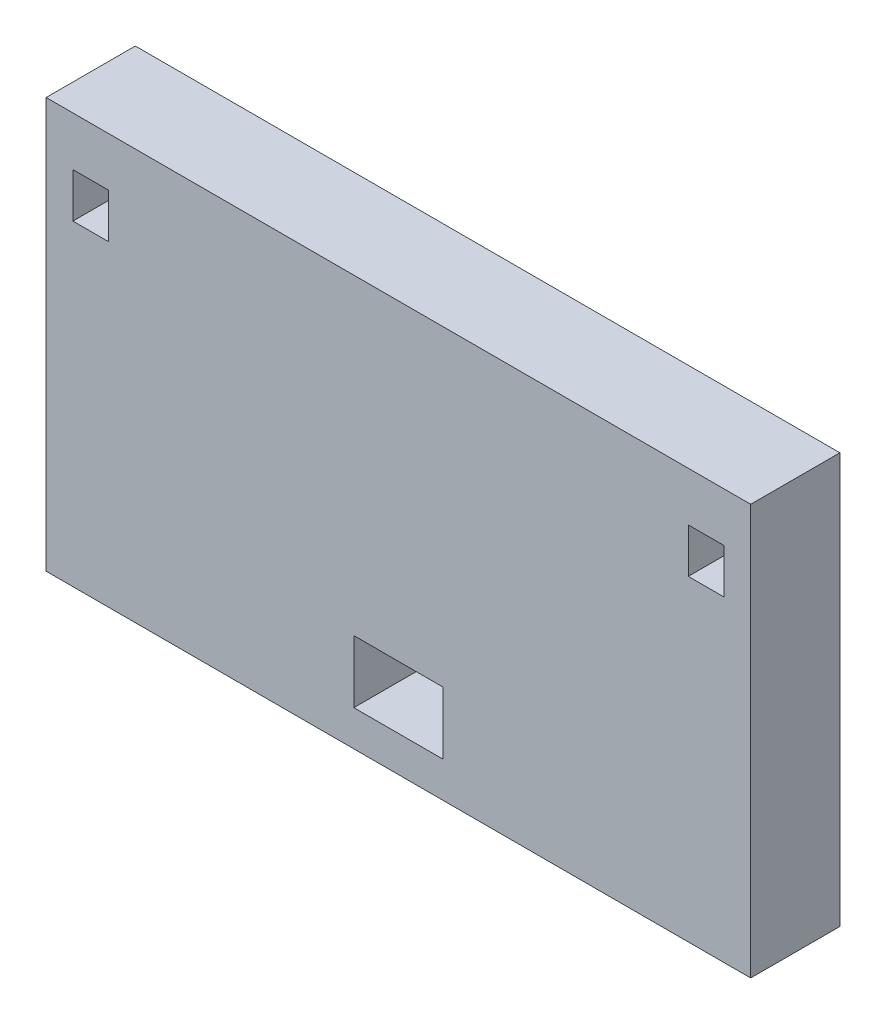
ISO-10303-21;
HEADER;
FILE_DESCRIPTION(('STEP AP214'),'2;1');
FILE_NAME('part.step','',(''),(''),'','','');
FILE_SCHEMA(('AUTOMOTIVE_DESIGN { 1 0 10303 214 1 1 1 1 }'));
ENDSEC;
DATA;
#1=APPLICATION_CONTEXT('core data for automotive mechanical design processes');
#2=APPLICATION_PROTOCOL_DEFINITION('international standard','automotive_design',2000,#1);
#3=PRODUCT_CONTEXT('',#1,'mechanical');
#4=PRODUCT('Part','Part','',(#3));
#5=PRODUCT_RELATED_PRODUCT_CATEGORY('part','',(#4));
#6=PRODUCT_DEFINITION_FORMATION('','',#4);
#7=PRODUCT_DEFINITION_CONTEXT('part definition',#1,'design');
#8=PRODUCT_DEFINITION('design','',#6,#7);
#9=PRODUCT_DEFINITION_SHAPE('','',#8);
#10=(LENGTH_UNIT() NAMED_UNIT(*) SI_UNIT(.MILLI.,.METRE.));
#11=(NAMED_UNIT(*) PLANE_ANGLE_UNIT() SI_UNIT($,.RADIAN.));
#12=(NAMED_UNIT(*) SI_UNIT($,.STERADIAN.) SOLID_ANGLE_UNIT());
#13=UNCERTAINTY_MEASURE_WITH_UNIT(LENGTH_MEASURE(1.E-05),#10,'distance_accuracy_value','');
#14=(GEOMETRIC_REPRESENTATION_CONTEXT(3) GLOBAL_UNCERTAINTY_ASSIGNED_CONTEXT((#13)) GLOBAL_UNIT_ASSIGNED_CONTEXT((#10,
#11,#12)) REPRESENTATION_CONTEXT('',''));
#15=CARTESIAN_POINT('',(0.,0.,0.));
#16=DIRECTION('',(0.,0.,1.));
#17=DIRECTION('',(1.,0.,0.));
#18=AXIS2_PLACEMENT_3D('',#15,#16,#17);
#19=CARTESIAN_POINT('',(0.,0.,10.));
#20=DIRECTION('',(0.,0.,-1.));
#21=DIRECTION('',(-1.,0.,0.));
#22=AXIS2_PLACEMENT_3D('',#19,#20,#21);
#23=PLANE('',#22);
#24=DIRECTION('',(0.,1.,0.));
#25=VECTOR('',#24,1.);
#26=CARTESIAN_POINT('',(36.5,33.1115422644165,10.));
#27=LINE('',#26,#25);
#28=CARTESIAN_POINT('',(36.5,33.1115422644165,10.));
#29=VERTEX_POINT('',#28);
#30=CARTESIAN_POINT('',(36.5,38.1115422644165,10.));
#31=VERTEX_POINT('',#30);
#32=EDGE_CURVE('E201',#29,#31,#27,.T.);
#33=ORIENTED_EDGE('',*,*,#32,.F.);
#34=DIRECTION('',(1.,0.,0.));
#35=VECTOR('',#34,1.);
#36=CARTESIAN_POINT('',(32.5,33.1115422644165,10.));
#37=LINE('',#36,#35);
#38=CARTESIAN_POINT('',(32.5,33.1115422644165,10.));
#39=VERTEX_POINT('',#38);
#40=EDGE_CURVE('E212',#39,#29,#37,.T.);
#41=ORIENTED_EDGE('',*,*,#40,.F.);
#42=DIRECTION('',(0.,-1.,0.));
#43=VECTOR('',#42,1.);
#44=CARTESIAN_POINT('',(32.5,33.1115422644165,10.));
#45=LINE('',#44,#43);
#46=CARTESIAN_POINT('',(32.5,38.1115422644165,10.));
#47=VERTEX_POINT('',#46);
#48=EDGE_CURVE('E208',#47,#39,#45,.T.);
#49=ORIENTED_EDGE('',*,*,#48,.F.);
#50=DIRECTION('',(-1.,0.,0.));
#51=VECTOR('',#50,1.);
#52=CARTESIAN_POINT('',(32.5,38.1115422644165,10.));
#53=LINE('',#52,#51);
#54=EDGE_CURVE('E204',#31,#47,#53,.T.);
#55=ORIENTED_EDGE('',*,*,#54,.F.);
#56=EDGE_LOOP('',(#33,#41,#49,#55));
#57=FACE_BOUND('',#56,.T.);
#58=DIRECTION('',(0.,-1.,0.));
#59=VECTOR('',#58,1.);
#60=CARTESIAN_POINT('',(-39.5,-2.38845773558347,10.));
#61=LINE('',#60,#59);
#62=CARTESIAN_POINT('',(-39.5,43.6115422644165,10.));
#63=VERTEX_POINT('',#62);
#64=CARTESIAN_POINT('',(-39.5,-2.38845773558347,10.));
#65=VERTEX_POINT('',#64);
#66=EDGE_CURVE('E287',#63,#65,#61,.T.);
#67=ORIENTED_EDGE('',*,*,#66,.T.);
#68=DIRECTION('',(1.,0.,0.));
#69=VECTOR('',#68,1.);
#70=CARTESIAN_POINT('',(-39.5,-2.38845773558347,10.));
#71=LINE('',#70,#69);
#72=CARTESIAN_POINT('',(39.5,-2.38845773558347,10.));
#73=VERTEX_POINT('',#72);
#74=EDGE_CURVE('E291',#65,#73,#71,.T.);
#75=ORIENTED_EDGE('',*,*,#74,.T.);
#76=DIRECTION('',(0.,1.,0.));
#77=VECTOR('',#76,1.);
#78=CARTESIAN_POINT('',(39.5,-2.38845773558347,10.));
#79=LINE('',#78,#77);
#80=CARTESIAN_POINT('',(39.5,43.6115422644165,10.));
#81=VERTEX_POINT('',#80);
#82=EDGE_CURVE('E295',#73,#81,#79,.T.);
#83=ORIENTED_EDGE('',*,*,#82,.T.);
#84=DIRECTION('',(-1.,0.,0.));
#85=VECTOR('',#84,1.);
#86=CARTESIAN_POINT('',(-39.5,43.6115422644165,10.));
#87=LINE('',#86,#85);
#88=EDGE_CURVE('E298',#81,#63,#87,.T.);
#89=ORIENTED_EDGE('',*,*,#88,.T.);
#90=EDGE_LOOP('',(#67,#75,#83,#89));
#91=FACE_BOUND('',#90,.T.);
#92=DIRECTION('',(0.,-1.,0.));
#93=VECTOR('',#92,1.);
#94=CARTESIAN_POINT('',(-5.,1.61154226441653,10.));
#95=LINE('',#94,#93);
#96=CARTESIAN_POINT('',(-5.,8.61154226441653,10.));
#97=VERTEX_POINT('',#96);
#98=CARTESIAN_POINT('',(-5.,1.61154226441653,10.));
#99=VERTEX_POINT('',#98);
#100=EDGE_CURVE('E244',#97,#99,#95,.T.);
#101=ORIENTED_EDGE('',*,*,#100,.F.);
#102=DIRECTION('',(-1.,0.,0.));
#103=VECTOR('',#102,1.);
#104=CARTESIAN_POINT('',(5.,8.61154226441653,10.));
#105=LINE('',#104,#103);
#106=CARTESIAN_POINT('',(5.,8.61154226441654,10.));
#107=VERTEX_POINT('',#106);
#108=EDGE_CURVE('E255',#107,#97,#105,.T.);
#109=ORIENTED_EDGE('',*,*,#108,.F.);
#110=DIRECTION('',(0.,1.,0.));
#111=VECTOR('',#110,1.);
#112=CARTESIAN_POINT('',(5.,1.61154226441654,10.));
#113=LINE('',#112,#111);
#114=CARTESIAN_POINT('',(5.,1.61154226441654,10.));
#115=VERTEX_POINT('',#114);
#116=EDGE_CURVE('E251',#115,#107,#113,.T.);
#117=ORIENTED_EDGE('',*,*,#116,.F.);
#118=DIRECTION('',(1.,0.,0.));
#119=VECTOR('',#118,1.);
#120=CARTESIAN_POINT('',(5.,1.61154226441654,10.));
#121=LINE('',#120,#119);
#122=EDGE_CURVE('E247',#99,#115,#121,.T.);
#123=ORIENTED_EDGE('',*,*,#122,.F.);
#124=EDGE_LOOP('',(#101,#109,#117,#123));
#125=FACE_BOUND('',#124,.T.);
#126=DIRECTION('',(0.,1.,0.));
#127=VECTOR('',#126,1.);
#128=CARTESIAN_POINT('',(-32.5,33.1115422644165,10.));
#129=LINE('',#128,#127);
#130=CARTESIAN_POINT('',(-32.5,33.1115422644165,10.));
#131=VERTEX_POINT('',#130);
#132=CARTESIAN_POINT('',(-32.5,38.1115422644165,10.));
#133=VERTEX_POINT('',#132);
#134=EDGE_CURVE('E153',#131,#133,#129,.T.);
#135=ORIENTED_EDGE('',*,*,#134,.F.);
#136=DIRECTION('',(1.,0.,0.));
#137=VECTOR('',#136,1.);
#138=CARTESIAN_POINT('',(-32.5,33.1115422644165,10.));
#139=LINE('',#138,#137);
#140=CARTESIAN_POINT('',(-36.5,33.1115422644165,10.));
#141=VERTEX_POINT('',#140);
#142=EDGE_CURVE('E179',#141,#131,#139,.T.);
#143=ORIENTED_EDGE('',*,*,#142,.F.);
#144=DIRECTION('',(0.,-1.,0.));
#145=VECTOR('',#144,1.);
#146=CARTESIAN_POINT('',(-36.5,33.1115422644165,10.));
#147=LINE('',#146,#145);
#148=CARTESIAN_POINT('',(-36.5,38.1115422644165,10.));
#149=VERTEX_POINT('',#148);
#150=EDGE_CURVE('E175',#149,#141,#147,.T.);
#151=ORIENTED_EDGE('',*,*,#150,.F.);
#152=DIRECTION('',(-1.,0.,0.));
#153=VECTOR('',#152,1.);
#154=CARTESIAN_POINT('',(-32.5,38.1115422644165,10.));
#155=LINE('',#154,#153);
#156=EDGE_CURVE('E162',#133,#149,#155,.T.);
#157=ORIENTED_EDGE('',*,*,#156,.F.);
#158=EDGE_LOOP('',(#135,#143,#151,#157));
#159=FACE_BOUND('',#158,.T.);
#160=ADVANCED_FACE('F39',(#57,#91,#125,#159),#23,.F.);
#161=CARTESIAN_POINT('',(0.,0.,0.));
#162=DIRECTION('',(0.,0.,-1.));
#163=DIRECTION('',(-1.,0.,0.));
#164=AXIS2_PLACEMENT_3D('',#161,#162,#163);
#165=PLANE('',#164);
#166=DIRECTION('',(0.,-1.,0.));
#167=VECTOR('',#166,1.);
#168=CARTESIAN_POINT('',(-39.5,-2.38845773558347,0.));
#169=LINE('',#168,#167);
#170=CARTESIAN_POINT('',(-39.5,43.6115422644165,0.));
#171=VERTEX_POINT('',#170);
#172=CARTESIAN_POINT('',(-39.5,-2.38845773558347,0.));
#173=VERTEX_POINT('',#172);
#174=EDGE_CURVE('E286',#171,#173,#169,.T.);
#175=ORIENTED_EDGE('',*,*,#174,.F.);
#176=DIRECTION('',(-1.,0.,0.));
#177=VECTOR('',#176,1.);
#178=CARTESIAN_POINT('',(-39.5,43.6115422644165,0.));
#179=LINE('',#178,#177);
#180=CARTESIAN_POINT('',(39.5,43.6115422644165,0.));
#181=VERTEX_POINT('',#180);
#182=EDGE_CURVE('E292',#181,#171,#179,.T.);
#183=ORIENTED_EDGE('',*,*,#182,.F.);
#184=DIRECTION('',(0.,1.,0.));
#185=VECTOR('',#184,1.);
#186=CARTESIAN_POINT('',(39.5,-2.38845773558347,0.));
#187=LINE('',#186,#185);
#188=CARTESIAN_POINT('',(39.5,-2.38845773558347,0.));
#189=VERTEX_POINT('',#188);
#190=EDGE_CURVE('E308',#189,#181,#187,.T.);
#191=ORIENTED_EDGE('',*,*,#190,.F.);
#192=DIRECTION('',(1.,0.,0.));
#193=VECTOR('',#192,1.);
#194=CARTESIAN_POINT('',(-39.5,-2.38845773558347,0.));
#195=LINE('',#194,#193);
#196=EDGE_CURVE('E305',#173,#189,#195,.T.);
#197=ORIENTED_EDGE('',*,*,#196,.F.);
#198=EDGE_LOOP('',(#175,#183,#191,#197));
#199=FACE_BOUND('',#198,.T.);
#200=DIRECTION('',(-1.,0.,0.));
#201=VECTOR('',#200,1.);
#202=CARTESIAN_POINT('',(5.,8.61154226441653,0.));
#203=LINE('',#202,#201);
#204=CARTESIAN_POINT('',(5.,8.61154226441653,0.));
#205=VERTEX_POINT('',#204);
#206=CARTESIAN_POINT('',(-5.,8.61154226441653,0.));
#207=VERTEX_POINT('',#206);
#208=EDGE_CURVE('E248',#205,#207,#203,.T.);
#209=ORIENTED_EDGE('',*,*,#208,.T.);
#210=DIRECTION('',(0.,-1.,0.));
#211=VECTOR('',#210,1.);
#212=CARTESIAN_POINT('',(-5.,1.61154226441653,0.));
#213=LINE('',#212,#211);
#214=CARTESIAN_POINT('',(-5.,1.61154226441653,0.));
#215=VERTEX_POINT('',#214);
#216=EDGE_CURVE('E243',#207,#215,#213,.T.);
#217=ORIENTED_EDGE('',*,*,#216,.T.);
#218=DIRECTION('',(1.,0.,0.));
#219=VECTOR('',#218,1.);
#220=CARTESIAN_POINT('',(5.,1.61154226441654,0.));
#221=LINE('',#220,#219);
#222=CARTESIAN_POINT('',(5.,1.61154226441654,0.));
#223=VERTEX_POINT('',#222);
#224=EDGE_CURVE('E262',#215,#223,#221,.T.);
#225=ORIENTED_EDGE('',*,*,#224,.T.);
#226=DIRECTION('',(0.,1.,0.));
#227=VECTOR('',#226,1.);
#228=CARTESIAN_POINT('',(5.,1.61154226441654,0.));
#229=LINE('',#228,#227);
#230=EDGE_CURVE('E266',#223,#205,#229,.T.);
#231=ORIENTED_EDGE('',*,*,#230,.T.);
#232=EDGE_LOOP('',(#209,#217,#225,#231));
#233=FACE_BOUND('',#232,.T.);
#234=DIRECTION('',(1.,0.,0.));
#235=VECTOR('',#234,1.);
#236=CARTESIAN_POINT('',(32.5,33.1115422644165,0.));
#237=LINE('',#236,#235);
#238=CARTESIAN_POINT('',(32.5,33.1115422644165,0.));
#239=VERTEX_POINT('',#238);
#240=CARTESIAN_POINT('',(36.5,33.1115422644165,0.));
#241=VERTEX_POINT('',#240);
#242=EDGE_CURVE('E205',#239,#241,#237,.T.);
#243=ORIENTED_EDGE('',*,*,#242,.T.);
#244=DIRECTION('',(0.,1.,0.));
#245=VECTOR('',#244,1.);
#246=CARTESIAN_POINT('',(36.5,33.1115422644165,0.));
#247=LINE('',#246,#245);
#248=CARTESIAN_POINT('',(36.5,38.1115422644165,0.));
#249=VERTEX_POINT('',#248);
#250=EDGE_CURVE('E171',#241,#249,#247,.T.);
#251=ORIENTED_EDGE('',*,*,#250,.T.);
#252=DIRECTION('',(-1.,0.,0.));
#253=VECTOR('',#252,1.);
#254=CARTESIAN_POINT('',(32.5,38.1115422644165,0.));
#255=LINE('',#254,#253);
#256=CARTESIAN_POINT('',(32.5,38.1115422644165,0.));
#257=VERTEX_POINT('',#256);
#258=EDGE_CURVE('E219',#249,#257,#255,.T.);
#259=ORIENTED_EDGE('',*,*,#258,.T.);
#260=DIRECTION('',(0.,-1.,0.));
#261=VECTOR('',#260,1.);
#262=CARTESIAN_POINT('',(32.5,33.1115422644165,0.));
#263=LINE('',#262,#261);
#264=EDGE_CURVE('E223',#257,#239,#263,.T.);
#265=ORIENTED_EDGE('',*,*,#264,.T.);
#266=EDGE_LOOP('',(#243,#251,#259,#265));
#267=FACE_BOUND('',#266,.T.);
#268=DIRECTION('',(1.,0.,0.));
#269=VECTOR('',#268,1.);
#270=CARTESIAN_POINT('',(-32.5,33.1115422644165,0.));
#271=LINE('',#270,#269);
#272=CARTESIAN_POINT('',(-36.5,33.1115422644165,0.));
#273=VERTEX_POINT('',#272);
#274=CARTESIAN_POINT('',(-32.5,33.1115422644165,0.));
#275=VERTEX_POINT('',#274);
#276=EDGE_CURVE('E163',#273,#275,#271,.T.);
#277=ORIENTED_EDGE('',*,*,#276,.T.);
#278=DIRECTION('',(0.,1.,0.));
#279=VECTOR('',#278,1.);
#280=CARTESIAN_POINT('',(-32.5,33.1115422644165,0.));
#281=LINE('',#280,#279);
#282=CARTESIAN_POINT('',(-32.5,38.1115422644165,0.));
#283=VERTEX_POINT('',#282);
#284=EDGE_CURVE('E63',#275,#283,#281,.T.);
#285=ORIENTED_EDGE('',*,*,#284,.T.);
#286=DIRECTION('',(-1.,0.,0.));
#287=VECTOR('',#286,1.);
#288=CARTESIAN_POINT('',(-32.5,38.1115422644165,0.));
#289=LINE('',#288,#287);
#290=CARTESIAN_POINT('',(-36.5,38.1115422644165,0.));
#291=VERTEX_POINT('',#290);
#292=EDGE_CURVE('E169',#283,#291,#289,.T.);
#293=ORIENTED_EDGE('',*,*,#292,.T.);
#294=DIRECTION('',(0.,-1.,0.));
#295=VECTOR('',#294,1.);
#296=CARTESIAN_POINT('',(-36.5,33.1115422644165,0.));
#297=LINE('',#296,#295);
#298=EDGE_CURVE('E188',#291,#273,#297,.T.);
#299=ORIENTED_EDGE('',*,*,#298,.T.);
#300=EDGE_LOOP('',(#277,#285,#293,#299));
#301=FACE_BOUND('',#300,.T.);
#302=ADVANCED_FACE('F331',(#199,#233,#267,#301),#165,.T.);
#303=CARTESIAN_POINT('',(-39.5,-2.38845773558347,10.));
#304=DIRECTION('',(1.,0.,0.));
#305=DIRECTION('',(0.,0.,-1.));
#306=AXIS2_PLACEMENT_3D('',#303,#304,#305);
#307=PLANE('',#306);
#308=ORIENTED_EDGE('',*,*,#174,.T.);
#309=DIRECTION('',(0.,0.,-1.));
#310=VECTOR('',#309,1.);
#311=CARTESIAN_POINT('',(-39.5,-2.38845773558347,10.));
#312=LINE('',#311,#310);
#313=EDGE_CURVE('E11',#65,#173,#312,.T.);
#314=ORIENTED_EDGE('',*,*,#313,.F.);
#315=ORIENTED_EDGE('',*,*,#66,.F.);
#316=DIRECTION('',(0.,0.,-1.));
#317=VECTOR('',#316,1.);
#318=CARTESIAN_POINT('',(-39.5,43.6115422644165,10.));
#319=LINE('',#318,#317);
#320=EDGE_CURVE('E301',#63,#171,#319,.T.);
#321=ORIENTED_EDGE('',*,*,#320,.T.);
#322=EDGE_LOOP('',(#308,#314,#315,#321));
#323=FACE_BOUND('',#322,.T.);
#324=ADVANCED_FACE('F41',(#323),#307,.F.);
#325=CARTESIAN_POINT('',(-39.5,-2.38845773558347,10.));
#326=DIRECTION('',(0.,1.,0.));
#327=DIRECTION('',(-1.,0.,0.));
#328=AXIS2_PLACEMENT_3D('',#325,#326,#327);
#329=PLANE('',#328);
#330=ORIENTED_EDGE('',*,*,#196,.T.);
#331=DIRECTION('',(0.,0.,-1.));
#332=VECTOR('',#331,1.);
#333=CARTESIAN_POINT('',(39.5,-2.38845773558347,10.));
#334=LINE('',#333,#332);
#335=EDGE_CURVE('E48',#73,#189,#334,.T.);
#336=ORIENTED_EDGE('',*,*,#335,.F.);
#337=ORIENTED_EDGE('',*,*,#74,.F.);
#338=ORIENTED_EDGE('',*,*,#313,.T.);
#339=EDGE_LOOP('',(#330,#336,#337,#338));
#340=FACE_BOUND('',#339,.T.);
#341=ADVANCED_FACE('F342',(#340),#329,.F.);
#342=CARTESIAN_POINT('',(39.5,-2.38845773558347,10.));
#343=DIRECTION('',(-1.,0.,0.));
#344=DIRECTION('',(0.,0.,1.));
#345=AXIS2_PLACEMENT_3D('',#342,#343,#344);
#346=PLANE('',#345);
#347=ORIENTED_EDGE('',*,*,#190,.T.);
#348=DIRECTION('',(0.,0.,-1.));
#349=VECTOR('',#348,1.);
#350=CARTESIAN_POINT('',(39.5,43.6115422644165,10.));
#351=LINE('',#350,#349);
#352=EDGE_CURVE('E316',#81,#181,#351,.T.);
#353=ORIENTED_EDGE('',*,*,#352,.F.);
#354=ORIENTED_EDGE('',*,*,#82,.F.);
#355=ORIENTED_EDGE('',*,*,#335,.T.);
#356=EDGE_LOOP('',(#347,#353,#354,#355));
#357=FACE_BOUND('',#356,.T.);
#358=ADVANCED_FACE('F325',(#357),#346,.F.);
#359=CARTESIAN_POINT('',(-39.5,43.6115422644165,10.));
#360=DIRECTION('',(0.,-1.,0.));
#361=DIRECTION('',(0.,0.,-1.));
#362=AXIS2_PLACEMENT_3D('',#359,#360,#361);
#363=PLANE('',#362);
#364=ORIENTED_EDGE('',*,*,#182,.T.);
#365=ORIENTED_EDGE('',*,*,#320,.F.);
#366=ORIENTED_EDGE('',*,*,#88,.F.);
#367=ORIENTED_EDGE('',*,*,#352,.T.);
#368=EDGE_LOOP('',(#364,#365,#366,#367));
#369=FACE_BOUND('',#368,.T.);
#370=ADVANCED_FACE('F335',(#369),#363,.F.);
#371=CARTESIAN_POINT('',(-5.,1.61154226441653,10.));
#372=DIRECTION('',(1.,0.,0.));
#373=DIRECTION('',(0.,0.,-1.));
#374=AXIS2_PLACEMENT_3D('',#371,#372,#373);
#375=PLANE('',#374);
#376=ORIENTED_EDGE('',*,*,#216,.F.);
#377=DIRECTION('',(0.,0.,-1.));
#378=VECTOR('',#377,1.);
#379=CARTESIAN_POINT('',(-5.,8.61154226441653,10.));
#380=LINE('',#379,#378);
#381=EDGE_CURVE('E258',#97,#207,#380,.T.);
#382=ORIENTED_EDGE('',*,*,#381,.F.);
#383=ORIENTED_EDGE('',*,*,#100,.T.);
#384=DIRECTION('',(0.,0.,-1.));
#385=VECTOR('',#384,1.);
#386=CARTESIAN_POINT('',(-5.,1.61154226441653,10.));
#387=LINE('',#386,#385);
#388=EDGE_CURVE('E282',#99,#215,#387,.T.);
#389=ORIENTED_EDGE('',*,*,#388,.T.);
#390=EDGE_LOOP('',(#376,#382,#383,#389));
#391=FACE_BOUND('',#390,.T.);
#392=ADVANCED_FACE('F358',(#391),#375,.T.);
#393=CARTESIAN_POINT('',(5.,1.61154226441654,10.));
#394=DIRECTION('',(0.,1.,0.));
#395=DIRECTION('',(-1.,0.,0.));
#396=AXIS2_PLACEMENT_3D('',#393,#394,#395);
#397=PLANE('',#396);
#398=ORIENTED_EDGE('',*,*,#224,.F.);
#399=ORIENTED_EDGE('',*,*,#388,.F.);
#400=ORIENTED_EDGE('',*,*,#122,.T.);
#401=DIRECTION('',(0.,0.,-1.));
#402=VECTOR('',#401,1.);
#403=CARTESIAN_POINT('',(5.,1.61154226441654,10.));
#404=LINE('',#403,#402);
#405=EDGE_CURVE('E279',#115,#223,#404,.T.);
#406=ORIENTED_EDGE('',*,*,#405,.T.);
#407=EDGE_LOOP('',(#398,#399,#400,#406));
#408=FACE_BOUND('',#407,.T.);
#409=ADVANCED_FACE('F365',(#408),#397,.T.);
#410=CARTESIAN_POINT('',(5.,1.61154226441654,10.));
#411=DIRECTION('',(-1.,0.,0.));
#412=DIRECTION('',(0.,0.,1.));
#413=AXIS2_PLACEMENT_3D('',#410,#411,#412);
#414=PLANE('',#413);
#415=ORIENTED_EDGE('',*,*,#230,.F.);
#416=ORIENTED_EDGE('',*,*,#405,.F.);
#417=ORIENTED_EDGE('',*,*,#116,.T.);
#418=DIRECTION('',(0.,0.,-1.));
#419=VECTOR('',#418,1.);
#420=CARTESIAN_POINT('',(5.,8.61154226441653,10.));
#421=LINE('',#420,#419);
#422=EDGE_CURVE('E276',#107,#205,#421,.T.);
#423=ORIENTED_EDGE('',*,*,#422,.T.);
#424=EDGE_LOOP('',(#415,#416,#417,#423));
#425=FACE_BOUND('',#424,.T.);
#426=ADVANCED_FACE('F370',(#425),#414,.T.);
#427=CARTESIAN_POINT('',(5.,8.61154226441653,10.));
#428=DIRECTION('',(0.,-1.,0.));
#429=DIRECTION('',(1.,0.,0.));
#430=AXIS2_PLACEMENT_3D('',#427,#428,#429);
#431=PLANE('',#430);
#432=ORIENTED_EDGE('',*,*,#208,.F.);
#433=ORIENTED_EDGE('',*,*,#422,.F.);
#434=ORIENTED_EDGE('',*,*,#108,.T.);
#435=ORIENTED_EDGE('',*,*,#381,.T.);
#436=EDGE_LOOP('',(#432,#433,#434,#435));
#437=FACE_BOUND('',#436,.T.);
#438=ADVANCED_FACE('F377',(#437),#431,.T.);
#439=CARTESIAN_POINT('',(36.5,33.1115422644165,10.));
#440=DIRECTION('',(-1.,0.,0.));
#441=DIRECTION('',(0.,0.,1.));
#442=AXIS2_PLACEMENT_3D('',#439,#440,#441);
#443=PLANE('',#442);
#444=ORIENTED_EDGE('',*,*,#250,.F.);
#445=DIRECTION('',(0.,0.,-1.));
#446=VECTOR('',#445,1.);
#447=CARTESIAN_POINT('',(36.5,33.1115422644165,10.));
#448=LINE('',#447,#446);
#449=EDGE_CURVE('E215',#29,#241,#448,.T.);
#450=ORIENTED_EDGE('',*,*,#449,.F.);
#451=ORIENTED_EDGE('',*,*,#32,.T.);
#452=DIRECTION('',(0.,0.,-1.));
#453=VECTOR('',#452,1.);
#454=CARTESIAN_POINT('',(36.5,38.1115422644165,10.));
#455=LINE('',#454,#453);
#456=EDGE_CURVE('E239',#31,#249,#455,.T.);
#457=ORIENTED_EDGE('',*,*,#456,.T.);
#458=EDGE_LOOP('',(#444,#450,#451,#457));
#459=FACE_BOUND('',#458,.T.);
#460=ADVANCED_FACE('F390',(#459),#443,.T.);
#461=CARTESIAN_POINT('',(32.5,38.1115422644165,10.));
#462=DIRECTION('',(0.,-1.,0.));
#463=DIRECTION('',(1.,0.,0.));
#464=AXIS2_PLACEMENT_3D('',#461,#462,#463);
#465=PLANE('',#464);
#466=ORIENTED_EDGE('',*,*,#258,.F.);
#467=ORIENTED_EDGE('',*,*,#456,.F.);
#468=ORIENTED_EDGE('',*,*,#54,.T.);
#469=DIRECTION('',(0.,0.,-1.));
#470=VECTOR('',#469,1.);
#471=CARTESIAN_POINT('',(32.5,38.1115422644165,10.));
#472=LINE('',#471,#470);
#473=EDGE_CURVE('E236',#47,#257,#472,.T.);
#474=ORIENTED_EDGE('',*,*,#473,.T.);
#475=EDGE_LOOP('',(#466,#467,#468,#474));
#476=FACE_BOUND('',#475,.T.);
#477=ADVANCED_FACE('F395',(#476),#465,.T.);
#478=CARTESIAN_POINT('',(32.5,33.1115422644165,10.));
#479=DIRECTION('',(1.,0.,0.));
#480=DIRECTION('',(0.,0.,-1.));
#481=AXIS2_PLACEMENT_3D('',#478,#479,#480);
#482=PLANE('',#481);
#483=ORIENTED_EDGE('',*,*,#264,.F.);
#484=ORIENTED_EDGE('',*,*,#473,.F.);
#485=ORIENTED_EDGE('',*,*,#48,.T.);
#486=DIRECTION('',(0.,0.,-1.));
#487=VECTOR('',#486,1.);
#488=CARTESIAN_POINT('',(32.5,33.1115422644165,10.));
#489=LINE('',#488,#487);
#490=EDGE_CURVE('E233',#39,#239,#489,.T.);
#491=ORIENTED_EDGE('',*,*,#490,.T.);
#492=EDGE_LOOP('',(#483,#484,#485,#491));
#493=FACE_BOUND('',#492,.T.);
#494=ADVANCED_FACE('F399',(#493),#482,.T.);
#495=CARTESIAN_POINT('',(32.5,33.1115422644165,10.));
#496=DIRECTION('',(0.,1.,0.));
#497=DIRECTION('',(0.,0.,1.));
#498=AXIS2_PLACEMENT_3D('',#495,#496,#497);
#499=PLANE('',#498);
#500=ORIENTED_EDGE('',*,*,#242,.F.);
#501=ORIENTED_EDGE('',*,*,#490,.F.);
#502=ORIENTED_EDGE('',*,*,#40,.T.);
#503=ORIENTED_EDGE('',*,*,#449,.T.);
#504=EDGE_LOOP('',(#500,#501,#502,#503));
#505=FACE_BOUND('',#504,.T.);
#506=ADVANCED_FACE('F403',(#505),#499,.T.);
#507=CARTESIAN_POINT('',(-32.5,33.1115422644165,10.));
#508=DIRECTION('',(-1.,0.,0.));
#509=DIRECTION('',(0.,0.,1.));
#510=AXIS2_PLACEMENT_3D('',#507,#508,#509);
#511=PLANE('',#510);
#512=ORIENTED_EDGE('',*,*,#284,.F.);
#513=DIRECTION('',(0.,0.,-1.));
#514=VECTOR('',#513,1.);
#515=CARTESIAN_POINT('',(-32.5,33.1115422644165,10.));
#516=LINE('',#515,#514);
#517=EDGE_CURVE('E157',#131,#275,#516,.T.);
#518=ORIENTED_EDGE('',*,*,#517,.F.);
#519=ORIENTED_EDGE('',*,*,#134,.T.);
#520=DIRECTION('',(0.,0.,-1.));
#521=VECTOR('',#520,1.);
#522=CARTESIAN_POINT('',(-32.5,38.1115422644165,10.));
#523=LINE('',#522,#521);
#524=EDGE_CURVE('E156',#133,#283,#523,.T.);
#525=ORIENTED_EDGE('',*,*,#524,.T.);
#526=EDGE_LOOP('',(#512,#518,#519,#525));
#527=FACE_BOUND('',#526,.T.);
#528=ADVANCED_FACE('F155',(#527),#511,.T.);
#529=CARTESIAN_POINT('',(-32.5,38.1115422644165,10.));
#530=DIRECTION('',(0.,-1.,0.));
#531=DIRECTION('',(0.,0.,-1.));
#532=AXIS2_PLACEMENT_3D('',#529,#530,#531);
#533=PLANE('',#532);
#534=ORIENTED_EDGE('',*,*,#292,.F.);
#535=ORIENTED_EDGE('',*,*,#524,.F.);
#536=ORIENTED_EDGE('',*,*,#156,.T.);
#537=DIRECTION('',(0.,0.,-1.));
#538=VECTOR('',#537,1.);
#539=CARTESIAN_POINT('',(-36.5,38.1115422644165,10.));
#540=LINE('',#539,#538);
#541=EDGE_CURVE('E172',#149,#291,#540,.T.);
#542=ORIENTED_EDGE('',*,*,#541,.T.);
#543=EDGE_LOOP('',(#534,#535,#536,#542));
#544=FACE_BOUND('',#543,.T.);
#545=ADVANCED_FACE('F166',(#544),#533,.T.);
#546=CARTESIAN_POINT('',(-36.5,33.1115422644165,10.));
#547=DIRECTION('',(1.,0.,0.));
#548=DIRECTION('',(0.,0.,-1.));
#549=AXIS2_PLACEMENT_3D('',#546,#547,#548);
#550=PLANE('',#549);
#551=ORIENTED_EDGE('',*,*,#298,.F.);
#552=ORIENTED_EDGE('',*,*,#541,.F.);
#553=ORIENTED_EDGE('',*,*,#150,.T.);
#554=DIRECTION('',(0.,0.,-1.));
#555=VECTOR('',#554,1.);
#556=CARTESIAN_POINT('',(-36.5,33.1115422644165,10.));
#557=LINE('',#556,#555);
#558=EDGE_CURVE('E55',#141,#273,#557,.T.);
#559=ORIENTED_EDGE('',*,*,#558,.T.);
#560=EDGE_LOOP('',(#551,#552,#553,#559));
#561=FACE_BOUND('',#560,.T.);
#562=ADVANCED_FACE('F412',(#561),#550,.T.);
#563=CARTESIAN_POINT('',(-32.5,33.1115422644165,10.));
#564=DIRECTION('',(0.,1.,0.));
#565=DIRECTION('',(0.,0.,1.));
#566=AXIS2_PLACEMENT_3D('',#563,#564,#565);
#567=PLANE('',#566);
#568=ORIENTED_EDGE('',*,*,#276,.F.);
#569=ORIENTED_EDGE('',*,*,#558,.F.);
#570=ORIENTED_EDGE('',*,*,#142,.T.);
#571=ORIENTED_EDGE('',*,*,#517,.T.);
#572=EDGE_LOOP('',(#568,#569,#570,#571));
#573=FACE_BOUND('',#572,.T.);
#574=ADVANCED_FACE('F415',(#573),#567,.T.);
#575=CLOSED_SHELL('',(#160,#302,#324,#341,#358,#370,#392,#409,#426,#438,#460,#477,#494,#506,
#528,#545,#562,#574));
#576=MANIFOLD_SOLID_BREP('B2',#575);
#577=ADVANCED_BREP_SHAPE_REPRESENTATION('',(#18,#576),#14);
#578=SHAPE_DEFINITION_REPRESENTATION(#9,#577);
ENDSEC;
END-ISO-10303-21;
